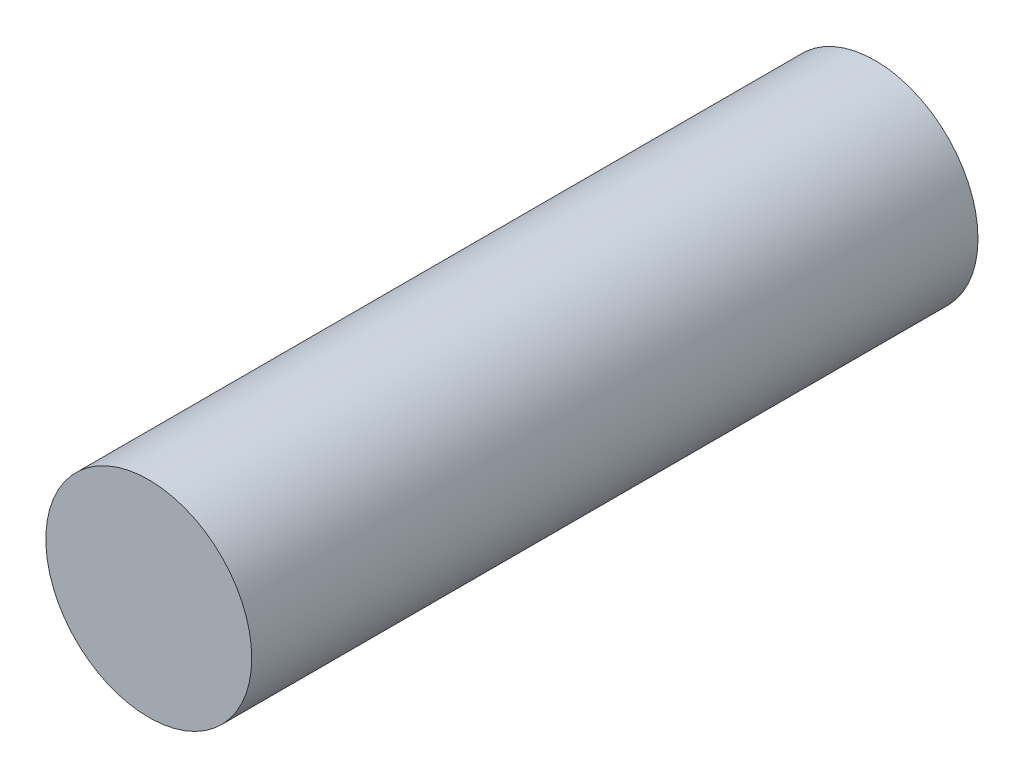
ISO-10303-21;
HEADER;
FILE_DESCRIPTION(('STEP AP214'),'2;1');
FILE_NAME('part.step','',(''),(''),'','','');
FILE_SCHEMA(('AUTOMOTIVE_DESIGN { 1 0 10303 214 1 1 1 1 }'));
ENDSEC;
DATA;
#1=APPLICATION_CONTEXT('core data for automotive mechanical design processes');
#2=APPLICATION_PROTOCOL_DEFINITION('international standard','automotive_design',2000,#1);
#3=PRODUCT_CONTEXT('',#1,'mechanical');
#4=PRODUCT('Part','Part','',(#3));
#5=PRODUCT_RELATED_PRODUCT_CATEGORY('part','',(#4));
#6=PRODUCT_DEFINITION_FORMATION('','',#4);
#7=PRODUCT_DEFINITION_CONTEXT('part definition',#1,'design');
#8=PRODUCT_DEFINITION('design','',#6,#7);
#9=PRODUCT_DEFINITION_SHAPE('','',#8);
#10=(LENGTH_UNIT() NAMED_UNIT(*) SI_UNIT(.MILLI.,.METRE.));
#11=(NAMED_UNIT(*) PLANE_ANGLE_UNIT() SI_UNIT($,.RADIAN.));
#12=(NAMED_UNIT(*) SI_UNIT($,.STERADIAN.) SOLID_ANGLE_UNIT());
#13=UNCERTAINTY_MEASURE_WITH_UNIT(LENGTH_MEASURE(1.E-05),#10,'distance_accuracy_value','');
#14=(GEOMETRIC_REPRESENTATION_CONTEXT(3) GLOBAL_UNCERTAINTY_ASSIGNED_CONTEXT((#13)) GLOBAL_UNIT_ASSIGNED_CONTEXT((#10,
#11,#12)) REPRESENTATION_CONTEXT('',''));
#15=CARTESIAN_POINT('',(0.,0.,0.));
#16=DIRECTION('',(0.,0.,1.));
#17=DIRECTION('',(1.,0.,0.));
#18=AXIS2_PLACEMENT_3D('',#15,#16,#17);
#19=CARTESIAN_POINT('',(0.,0.,50.3399999999999));
#20=DIRECTION('',(0.,0.,-0.999999999999997));
#21=DIRECTION('',(-1.,0.,0.));
#22=AXIS2_PLACEMENT_3D('',#19,#20,#21);
#23=CYLINDRICAL_SURFACE('',#22,7.135);
#24=CARTESIAN_POINT('',(0.,0.,50.3399999999999));
#25=DIRECTION('',(0.,0.,0.999999999999997));
#26=DIRECTION('',(1.,0.,0.));
#27=AXIS2_PLACEMENT_3D('',#24,#25,#26);
#28=CIRCLE('',#27,7.135);
#29=CARTESIAN_POINT('',(7.135,0.,50.3399999999999));
#30=VERTEX_POINT('',#29);
#31=EDGE_CURVE('E12',#30,#30,#28,.T.);
#32=ORIENTED_EDGE('',*,*,#31,.F.);
#33=EDGE_LOOP('',(#32));
#34=FACE_BOUND('',#33,.T.);
#35=CARTESIAN_POINT('',(0.,0.,0.));
#36=DIRECTION('',(0.,0.,0.999999999999997));
#37=DIRECTION('',(1.,0.,0.));
#38=AXIS2_PLACEMENT_3D('',#35,#36,#37);
#39=CIRCLE('',#38,7.135);
#40=CARTESIAN_POINT('',(7.135,0.,0.));
#41=VERTEX_POINT('',#40);
#42=EDGE_CURVE('E41',#41,#41,#39,.T.);
#43=ORIENTED_EDGE('',*,*,#42,.T.);
#44=EDGE_LOOP('',(#43));
#45=FACE_BOUND('',#44,.T.);
#46=ADVANCED_FACE('F38',(#34,#45),#23,.T.);
#47=CARTESIAN_POINT('',(0.,0.,50.3399999999999));
#48=DIRECTION('',(0.,0.,0.999999999999997));
#49=DIRECTION('',(1.,0.,0.));
#50=AXIS2_PLACEMENT_3D('',#47,#48,#49);
#51=PLANE('',#50);
#52=ORIENTED_EDGE('',*,*,#31,.T.);
#53=EDGE_LOOP('',(#52));
#54=FACE_BOUND('',#53,.T.);
#55=ADVANCED_FACE('F53',(#54),#51,.T.);
#56=CARTESIAN_POINT('',(0.,0.,0.));
#57=DIRECTION('',(0.,0.,0.999999999999997));
#58=DIRECTION('',(1.,0.,0.));
#59=AXIS2_PLACEMENT_3D('',#56,#57,#58);
#60=PLANE('',#59);
#61=ORIENTED_EDGE('',*,*,#42,.F.);
#62=EDGE_LOOP('',(#61));
#63=FACE_BOUND('',#62,.T.);
#64=ADVANCED_FACE('F51',(#63),#60,.F.);
#65=CLOSED_SHELL('',(#46,#55,#64));
#66=MANIFOLD_SOLID_BREP('B2',#65);
#67=ADVANCED_BREP_SHAPE_REPRESENTATION('',(#18,#66),#14);
#68=SHAPE_DEFINITION_REPRESENTATION(#9,#67);
ENDSEC;
END-ISO-10303-21;
